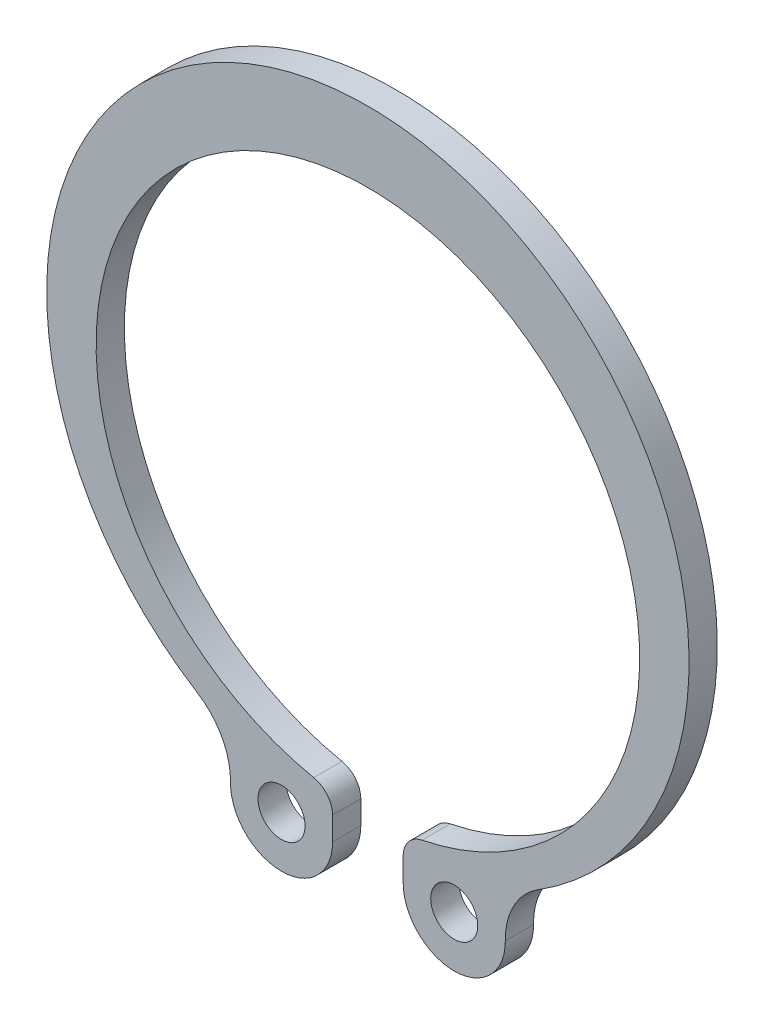
ISO-10303-21;
HEADER;
FILE_DESCRIPTION(('STEP AP214'),'2;1');
FILE_NAME('part.step','',(''),(''),'','','');
FILE_SCHEMA(('AUTOMOTIVE_DESIGN { 1 0 10303 214 1 1 1 1 }'));
ENDSEC;
DATA;
#1=APPLICATION_CONTEXT('core data for automotive mechanical design processes');
#2=APPLICATION_PROTOCOL_DEFINITION('international standard','automotive_design',2000,#1);
#3=PRODUCT_CONTEXT('',#1,'mechanical');
#4=PRODUCT('Part','Part','',(#3));
#5=PRODUCT_RELATED_PRODUCT_CATEGORY('part','',(#4));
#6=PRODUCT_DEFINITION_FORMATION('','',#4);
#7=PRODUCT_DEFINITION_CONTEXT('part definition',#1,'design');
#8=PRODUCT_DEFINITION('design','',#6,#7);
#9=PRODUCT_DEFINITION_SHAPE('','',#8);
#10=(LENGTH_UNIT() NAMED_UNIT(*) SI_UNIT(.MILLI.,.METRE.));
#11=(NAMED_UNIT(*) PLANE_ANGLE_UNIT() SI_UNIT($,.RADIAN.));
#12=(NAMED_UNIT(*) SI_UNIT($,.STERADIAN.) SOLID_ANGLE_UNIT());
#13=UNCERTAINTY_MEASURE_WITH_UNIT(LENGTH_MEASURE(1.E-05),#10,'distance_accuracy_value','');
#14=(GEOMETRIC_REPRESENTATION_CONTEXT(3) GLOBAL_UNCERTAINTY_ASSIGNED_CONTEXT((#13)) GLOBAL_UNIT_ASSIGNED_CONTEXT((#10,
#11,#12)) REPRESENTATION_CONTEXT('',''));
#15=CARTESIAN_POINT('',(0.,0.,0.));
#16=DIRECTION('',(0.,0.,1.));
#17=DIRECTION('',(1.,0.,0.));
#18=AXIS2_PLACEMENT_3D('',#15,#16,#17);
#19=CARTESIAN_POINT('',(2.50000000000009,-13.1984755152824,1.2));
#20=DIRECTION('',(0.,0.,1.));
#21=DIRECTION('',(1.,0.,0.));
#22=AXIS2_PLACEMENT_3D('',#19,#20,#21);
#23=PLANE('',#22);
#24=CARTESIAN_POINT('',(-3.66946668671078,-14.1830008896256,1.2));
#25=DIRECTION('',(0.,0.,1.));
#26=DIRECTION('',(1.,0.,0.));
#27=AXIS2_PLACEMENT_3D('',#24,#25,#26);
#28=CIRCLE('',#27,1.);
#29=CARTESIAN_POINT('',(-2.66946668671078,-14.1830008896256,1.2));
#30=VERTEX_POINT('',#29);
#31=EDGE_CURVE('E158',#30,#30,#28,.T.);
#32=ORIENTED_EDGE('',*,*,#31,.F.);
#33=EDGE_LOOP('',(#32));
#34=FACE_BOUND('',#33,.T.);
#35=CARTESIAN_POINT('',(2.50000000000009,-13.1984755152824,1.2));
#36=DIRECTION('',(0.,0.,1.));
#37=DIRECTION('',(1.,0.,0.));
#38=AXIS2_PLACEMENT_3D('',#35,#36,#37);
#39=CIRCLE('',#38,1.);
#40=CARTESIAN_POINT('',(2.30079681274909,-12.2185173068933,1.2));
#41=VERTEX_POINT('',#40);
#42=CARTESIAN_POINT('',(1.50000000000009,-13.1984755152824,1.2));
#43=VERTEX_POINT('',#42);
#44=EDGE_CURVE('E182',#41,#43,#39,.T.);
#45=ORIENTED_EDGE('',*,*,#44,.T.);
#46=DIRECTION('',(0.,-1.,0.));
#47=VECTOR('',#46,1.);
#48=CARTESIAN_POINT('',(1.5000000000001,-14.1830008896256,1.2));
#49=LINE('',#48,#47);
#50=CARTESIAN_POINT('',(1.5000000000001,-14.1830008896256,1.2));
#51=VERTEX_POINT('',#50);
#52=EDGE_CURVE('E106',#43,#51,#49,.T.);
#53=ORIENTED_EDGE('',*,*,#52,.T.);
#54=CARTESIAN_POINT('',(3.66946668671088,-14.1830008896256,1.2));
#55=DIRECTION('',(0.,0.,1.));
#56=DIRECTION('',(-1.,0.,0.));
#57=AXIS2_PLACEMENT_3D('',#54,#55,#56);
#58=CIRCLE('',#57,2.16946668671078);
#59=CARTESIAN_POINT('',(5.83871969722187,-14.1525528825175,1.2));
#60=VERTEX_POINT('',#59);
#61=EDGE_CURVE('E211',#51,#60,#58,.T.);
#62=ORIENTED_EDGE('',*,*,#61,.T.);
#63=CARTESIAN_POINT('',(8.83842421971891,-14.1104485156315,1.2));
#64=DIRECTION('',(0.,0.,-1.));
#65=DIRECTION('',(1.,0.,0.));
#66=AXIS2_PLACEMENT_3D('',#63,#64,#65);
#67=CIRCLE('',#66,3.00000000000001);
#68=CARTESIAN_POINT('',(7.24591535130107,-11.5680253596619,1.2));
#69=VERTEX_POINT('',#68);
#70=EDGE_CURVE('E231',#60,#69,#67,.T.);
#71=ORIENTED_EDGE('',*,*,#70,.T.);
#72=CARTESIAN_POINT('',(0.,0.,1.2));
#73=DIRECTION('',(0.,0.,1.));
#74=DIRECTION('',(1.,0.,0.));
#75=AXIS2_PLACEMENT_3D('',#72,#73,#74);
#76=CIRCLE('',#75,13.65);
#77=CARTESIAN_POINT('',(-7.245915351301,-11.5680253596619,1.2));
#78=VERTEX_POINT('',#77);
#79=EDGE_CURVE('E227',#69,#78,#76,.T.);
#80=ORIENTED_EDGE('',*,*,#79,.T.);
#81=CARTESIAN_POINT('',(-8.83842421971881,-14.1104485156315,1.2));
#82=DIRECTION('',(0.,0.,-1.));
#83=DIRECTION('',(-1.,0.,0.));
#84=AXIS2_PLACEMENT_3D('',#81,#82,#83);
#85=CIRCLE('',#84,3.);
#86=CARTESIAN_POINT('',(-5.83871969722178,-14.1525528825175,1.2));
#87=VERTEX_POINT('',#86);
#88=EDGE_CURVE('E230',#78,#87,#85,.T.);
#89=ORIENTED_EDGE('',*,*,#88,.T.);
#90=CARTESIAN_POINT('',(-3.66946668671078,-14.1830008896256,1.2));
#91=DIRECTION('',(0.,0.,1.));
#92=DIRECTION('',(1.,0.,0.));
#93=AXIS2_PLACEMENT_3D('',#90,#91,#92);
#94=CIRCLE('',#93,2.16946668671078);
#95=CARTESIAN_POINT('',(-1.5,-14.1830008896256,1.2));
#96=VERTEX_POINT('',#95);
#97=EDGE_CURVE('E131',#87,#96,#94,.T.);
#98=ORIENTED_EDGE('',*,*,#97,.T.);
#99=DIRECTION('',(0.,1.,0.));
#100=VECTOR('',#99,1.);
#101=CARTESIAN_POINT('',(-1.5,-14.1830008896256,1.2));
#102=LINE('',#101,#100);
#103=CARTESIAN_POINT('',(-1.5,-13.1984755152824,1.2));
#104=VERTEX_POINT('',#103);
#105=EDGE_CURVE('E125',#96,#104,#102,.T.);
#106=ORIENTED_EDGE('',*,*,#105,.T.);
#107=CARTESIAN_POINT('',(-2.5,-13.1984755152824,1.2));
#108=DIRECTION('',(0.,0.,1.));
#109=DIRECTION('',(-1.,0.,0.));
#110=AXIS2_PLACEMENT_3D('',#107,#108,#109);
#111=CIRCLE('',#110,1.);
#112=CARTESIAN_POINT('',(-2.300796812749,-12.2185173068933,1.2));
#113=VERTEX_POINT('',#112);
#114=EDGE_CURVE('E129',#104,#113,#111,.T.);
#115=ORIENTED_EDGE('',*,*,#114,.T.);
#116=CARTESIAN_POINT('',(0.,-0.9,1.2));
#117=DIRECTION('',(0.,0.,-1.));
#118=DIRECTION('',(1.,0.,0.));
#119=AXIS2_PLACEMENT_3D('',#116,#117,#118);
#120=CIRCLE('',#119,11.55);
#121=EDGE_CURVE('E57',#113,#41,#120,.T.);
#122=ORIENTED_EDGE('',*,*,#121,.T.);
#123=EDGE_LOOP('',(#45,#53,#62,#71,#80,#89,#98,#106,#115,#122));
#124=FACE_BOUND('',#123,.T.);
#125=CARTESIAN_POINT('',(3.66946668671088,-14.1830008896256,1.2));
#126=DIRECTION('',(0.,0.,1.));
#127=DIRECTION('',(-1.,0.,0.));
#128=AXIS2_PLACEMENT_3D('',#125,#126,#127);
#129=CIRCLE('',#128,1.);
#130=CARTESIAN_POINT('',(2.66946668671088,-14.1830008896256,1.2));
#131=VERTEX_POINT('',#130);
#132=EDGE_CURVE('E249',#131,#131,#129,.T.);
#133=ORIENTED_EDGE('',*,*,#132,.F.);
#134=EDGE_LOOP('',(#133));
#135=FACE_BOUND('',#134,.T.);
#136=ADVANCED_FACE('F39',(#34,#124,#135),#23,.T.);
#137=CARTESIAN_POINT('',(2.50000000000009,-13.1984755152824,0.));
#138=DIRECTION('',(0.,0.,1.));
#139=DIRECTION('',(1.,0.,0.));
#140=AXIS2_PLACEMENT_3D('',#137,#138,#139);
#141=PLANE('',#140);
#142=CARTESIAN_POINT('',(2.50000000000009,-13.1984755152824,0.));
#143=DIRECTION('',(0.,0.,1.));
#144=DIRECTION('',(1.,0.,0.));
#145=AXIS2_PLACEMENT_3D('',#142,#143,#144);
#146=CIRCLE('',#145,1.);
#147=CARTESIAN_POINT('',(2.30079681274909,-12.2185173068933,0.));
#148=VERTEX_POINT('',#147);
#149=CARTESIAN_POINT('',(1.50000000000009,-13.1984755152824,0.));
#150=VERTEX_POINT('',#149);
#151=EDGE_CURVE('E153',#148,#150,#146,.T.);
#152=ORIENTED_EDGE('',*,*,#151,.F.);
#153=CARTESIAN_POINT('',(0.,-0.9,0.));
#154=DIRECTION('',(0.,0.,-1.));
#155=DIRECTION('',(1.,0.,0.));
#156=AXIS2_PLACEMENT_3D('',#153,#154,#155);
#157=CIRCLE('',#156,11.55);
#158=CARTESIAN_POINT('',(-2.300796812749,-12.2185173068933,0.));
#159=VERTEX_POINT('',#158);
#160=EDGE_CURVE('E98',#159,#148,#157,.T.);
#161=ORIENTED_EDGE('',*,*,#160,.F.);
#162=CARTESIAN_POINT('',(-2.5,-13.1984755152824,0.));
#163=DIRECTION('',(0.,0.,1.));
#164=DIRECTION('',(-1.,0.,0.));
#165=AXIS2_PLACEMENT_3D('',#162,#163,#164);
#166=CIRCLE('',#165,1.);
#167=CARTESIAN_POINT('',(-1.5,-13.1984755152824,0.));
#168=VERTEX_POINT('',#167);
#169=EDGE_CURVE('E92',#168,#159,#166,.T.);
#170=ORIENTED_EDGE('',*,*,#169,.F.);
#171=DIRECTION('',(0.,1.,0.));
#172=VECTOR('',#171,1.);
#173=CARTESIAN_POINT('',(-1.5,-14.1830008896256,0.));
#174=LINE('',#173,#172);
#175=CARTESIAN_POINT('',(-1.5,-14.1830008896256,0.));
#176=VERTEX_POINT('',#175);
#177=EDGE_CURVE('E140',#176,#168,#174,.T.);
#178=ORIENTED_EDGE('',*,*,#177,.F.);
#179=CARTESIAN_POINT('',(-3.66946668671078,-14.1830008896256,0.));
#180=DIRECTION('',(0.,0.,1.));
#181=DIRECTION('',(1.,0.,0.));
#182=AXIS2_PLACEMENT_3D('',#179,#180,#181);
#183=CIRCLE('',#182,2.16946668671078);
#184=CARTESIAN_POINT('',(-5.83871969722178,-14.1525528825175,0.));
#185=VERTEX_POINT('',#184);
#186=EDGE_CURVE('E173',#185,#176,#183,.T.);
#187=ORIENTED_EDGE('',*,*,#186,.F.);
#188=CARTESIAN_POINT('',(-8.83842421971881,-14.1104485156315,0.));
#189=DIRECTION('',(0.,0.,-1.));
#190=DIRECTION('',(-1.,0.,0.));
#191=AXIS2_PLACEMENT_3D('',#188,#189,#190);
#192=CIRCLE('',#191,3.);
#193=CARTESIAN_POINT('',(-7.245915351301,-11.5680253596619,0.));
#194=VERTEX_POINT('',#193);
#195=EDGE_CURVE('E170',#194,#185,#192,.T.);
#196=ORIENTED_EDGE('',*,*,#195,.F.);
#197=CARTESIAN_POINT('',(0.,0.,0.));
#198=DIRECTION('',(0.,0.,1.));
#199=DIRECTION('',(1.,0.,0.));
#200=AXIS2_PLACEMENT_3D('',#197,#198,#199);
#201=CIRCLE('',#200,13.65);
#202=CARTESIAN_POINT('',(7.24591535130107,-11.5680253596619,0.));
#203=VERTEX_POINT('',#202);
#204=EDGE_CURVE('E167',#203,#194,#201,.T.);
#205=ORIENTED_EDGE('',*,*,#204,.F.);
#206=CARTESIAN_POINT('',(8.83842421971891,-14.1104485156315,0.));
#207=DIRECTION('',(0.,0.,-1.));
#208=DIRECTION('',(1.,0.,0.));
#209=AXIS2_PLACEMENT_3D('',#206,#207,#208);
#210=CIRCLE('',#209,3.00000000000001);
#211=CARTESIAN_POINT('',(5.83871969722187,-14.1525528825175,0.));
#212=VERTEX_POINT('',#211);
#213=EDGE_CURVE('E164',#212,#203,#210,.T.);
#214=ORIENTED_EDGE('',*,*,#213,.F.);
#215=CARTESIAN_POINT('',(3.66946668671088,-14.1830008896256,0.));
#216=DIRECTION('',(0.,0.,1.));
#217=DIRECTION('',(-1.,0.,0.));
#218=AXIS2_PLACEMENT_3D('',#215,#216,#217);
#219=CIRCLE('',#218,2.16946668671078);
#220=CARTESIAN_POINT('',(1.5000000000001,-14.1830008896256,0.));
#221=VERTEX_POINT('',#220);
#222=EDGE_CURVE('E161',#221,#212,#219,.T.);
#223=ORIENTED_EDGE('',*,*,#222,.F.);
#224=DIRECTION('',(0.,-1.,0.));
#225=VECTOR('',#224,1.);
#226=CARTESIAN_POINT('',(1.5000000000001,-14.1830008896256,0.));
#227=LINE('',#226,#225);
#228=EDGE_CURVE('E157',#150,#221,#227,.T.);
#229=ORIENTED_EDGE('',*,*,#228,.F.);
#230=EDGE_LOOP('',(#152,#161,#170,#178,#187,#196,#205,#214,#223,#229));
#231=FACE_BOUND('',#230,.T.);
#232=CARTESIAN_POINT('',(-3.66946668671078,-14.1830008896256,0.));
#233=DIRECTION('',(0.,0.,1.));
#234=DIRECTION('',(1.,0.,0.));
#235=AXIS2_PLACEMENT_3D('',#232,#233,#234);
#236=CIRCLE('',#235,1.);
#237=CARTESIAN_POINT('',(-2.66946668671078,-14.1830008896256,0.));
#238=VERTEX_POINT('',#237);
#239=EDGE_CURVE('E245',#238,#238,#236,.T.);
#240=ORIENTED_EDGE('',*,*,#239,.T.);
#241=EDGE_LOOP('',(#240));
#242=FACE_BOUND('',#241,.T.);
#243=CARTESIAN_POINT('',(3.66946668671088,-14.1830008896256,0.));
#244=DIRECTION('',(0.,0.,1.));
#245=DIRECTION('',(-1.,0.,0.));
#246=AXIS2_PLACEMENT_3D('',#243,#244,#245);
#247=CIRCLE('',#246,1.);
#248=CARTESIAN_POINT('',(2.66946668671088,-14.1830008896256,0.));
#249=VERTEX_POINT('',#248);
#250=EDGE_CURVE('E253',#249,#249,#247,.T.);
#251=ORIENTED_EDGE('',*,*,#250,.T.);
#252=EDGE_LOOP('',(#251));
#253=FACE_BOUND('',#252,.T.);
#254=ADVANCED_FACE('F215',(#231,#242,#253),#141,.F.);
#255=CARTESIAN_POINT('',(2.50000000000009,-13.1984755152824,1.2));
#256=DIRECTION('',(0.,0.,-1.));
#257=DIRECTION('',(-1.,0.,0.));
#258=AXIS2_PLACEMENT_3D('',#255,#256,#257);
#259=CYLINDRICAL_SURFACE('',#258,1.);
#260=ORIENTED_EDGE('',*,*,#151,.T.);
#261=DIRECTION('',(0.,0.,-1.));
#262=VECTOR('',#261,1.);
#263=CARTESIAN_POINT('',(1.50000000000009,-13.1984755152824,1.2));
#264=LINE('',#263,#262);
#265=EDGE_CURVE('E11',#43,#150,#264,.T.);
#266=ORIENTED_EDGE('',*,*,#265,.F.);
#267=ORIENTED_EDGE('',*,*,#44,.F.);
#268=DIRECTION('',(0.,0.,-1.));
#269=VECTOR('',#268,1.);
#270=CARTESIAN_POINT('',(2.30079681274909,-12.2185173068933,1.2));
#271=LINE('',#270,#269);
#272=EDGE_CURVE('E149',#41,#148,#271,.T.);
#273=ORIENTED_EDGE('',*,*,#272,.T.);
#274=EDGE_LOOP('',(#260,#266,#267,#273));
#275=FACE_BOUND('',#274,.T.);
#276=ADVANCED_FACE('F41',(#275),#259,.T.);
#277=CARTESIAN_POINT('',(1.5000000000001,-14.1830008896256,1.2));
#278=DIRECTION('',(1.,0.,0.));
#279=DIRECTION('',(0.,1.,0.));
#280=AXIS2_PLACEMENT_3D('',#277,#278,#279);
#281=PLANE('',#280);
#282=ORIENTED_EDGE('',*,*,#228,.T.);
#283=DIRECTION('',(0.,0.,-1.));
#284=VECTOR('',#283,1.);
#285=CARTESIAN_POINT('',(1.5000000000001,-14.1830008896256,1.2));
#286=LINE('',#285,#284);
#287=EDGE_CURVE('E49',#51,#221,#286,.T.);
#288=ORIENTED_EDGE('',*,*,#287,.F.);
#289=ORIENTED_EDGE('',*,*,#52,.F.);
#290=ORIENTED_EDGE('',*,*,#265,.T.);
#291=EDGE_LOOP('',(#282,#288,#289,#290));
#292=FACE_BOUND('',#291,.T.);
#293=ADVANCED_FACE('F295',(#292),#281,.F.);
#294=CARTESIAN_POINT('',(3.66946668671088,-14.1830008896256,1.2));
#295=DIRECTION('',(0.,0.,-1.));
#296=DIRECTION('',(-1.,0.,0.));
#297=AXIS2_PLACEMENT_3D('',#294,#295,#296);
#298=CYLINDRICAL_SURFACE('',#297,2.16946668671078);
#299=ORIENTED_EDGE('',*,*,#222,.T.);
#300=DIRECTION('',(0.,0.,-1.));
#301=VECTOR('',#300,1.);
#302=CARTESIAN_POINT('',(5.83871969722187,-14.1525528825175,1.2));
#303=LINE('',#302,#301);
#304=EDGE_CURVE('E201',#60,#212,#303,.T.);
#305=ORIENTED_EDGE('',*,*,#304,.F.);
#306=ORIENTED_EDGE('',*,*,#61,.F.);
#307=ORIENTED_EDGE('',*,*,#287,.T.);
#308=EDGE_LOOP('',(#299,#305,#306,#307));
#309=FACE_BOUND('',#308,.T.);
#310=ADVANCED_FACE('F209',(#309),#298,.T.);
#311=CARTESIAN_POINT('',(8.83842421971891,-14.1104485156315,1.2));
#312=DIRECTION('',(0.,0.,-1.));
#313=DIRECTION('',(-1.,0.,0.));
#314=AXIS2_PLACEMENT_3D('',#311,#312,#313);
#315=CYLINDRICAL_SURFACE('',#314,3.00000000000001);
#316=ORIENTED_EDGE('',*,*,#213,.T.);
#317=DIRECTION('',(0.,0.,-1.));
#318=VECTOR('',#317,1.);
#319=CARTESIAN_POINT('',(7.24591535130107,-11.5680253596619,1.2));
#320=LINE('',#319,#318);
#321=EDGE_CURVE('E197',#69,#203,#320,.T.);
#322=ORIENTED_EDGE('',*,*,#321,.F.);
#323=ORIENTED_EDGE('',*,*,#70,.F.);
#324=ORIENTED_EDGE('',*,*,#304,.T.);
#325=EDGE_LOOP('',(#316,#322,#323,#324));
#326=FACE_BOUND('',#325,.T.);
#327=ADVANCED_FACE('F221',(#326),#315,.F.);
#328=CARTESIAN_POINT('',(0.,0.,1.2));
#329=DIRECTION('',(0.,0.,-1.));
#330=DIRECTION('',(-1.,0.,0.));
#331=AXIS2_PLACEMENT_3D('',#328,#329,#330);
#332=CYLINDRICAL_SURFACE('',#331,13.65);
#333=ORIENTED_EDGE('',*,*,#204,.T.);
#334=DIRECTION('',(0.,0.,-1.));
#335=VECTOR('',#334,1.);
#336=CARTESIAN_POINT('',(-7.245915351301,-11.5680253596619,1.2));
#337=LINE('',#336,#335);
#338=EDGE_CURVE('E193',#78,#194,#337,.T.);
#339=ORIENTED_EDGE('',*,*,#338,.F.);
#340=ORIENTED_EDGE('',*,*,#79,.F.);
#341=ORIENTED_EDGE('',*,*,#321,.T.);
#342=EDGE_LOOP('',(#333,#339,#340,#341));
#343=FACE_BOUND('',#342,.T.);
#344=ADVANCED_FACE('F225',(#343),#332,.T.);
#345=CARTESIAN_POINT('',(-8.83842421971881,-14.1104485156315,1.2));
#346=DIRECTION('',(0.,0.,-1.));
#347=DIRECTION('',(-1.,0.,0.));
#348=AXIS2_PLACEMENT_3D('',#345,#346,#347);
#349=CYLINDRICAL_SURFACE('',#348,3.);
#350=ORIENTED_EDGE('',*,*,#195,.T.);
#351=DIRECTION('',(0.,0.,-1.));
#352=VECTOR('',#351,1.);
#353=CARTESIAN_POINT('',(-5.83871969722178,-14.1525528825175,1.2));
#354=LINE('',#353,#352);
#355=EDGE_CURVE('E189',#87,#185,#354,.T.);
#356=ORIENTED_EDGE('',*,*,#355,.F.);
#357=ORIENTED_EDGE('',*,*,#88,.F.);
#358=ORIENTED_EDGE('',*,*,#338,.T.);
#359=EDGE_LOOP('',(#350,#356,#357,#358));
#360=FACE_BOUND('',#359,.T.);
#361=ADVANCED_FACE('F285',(#360),#349,.F.);
#362=CARTESIAN_POINT('',(-3.66946668671078,-14.1830008896256,1.2));
#363=DIRECTION('',(0.,0.,-1.));
#364=DIRECTION('',(-1.,0.,0.));
#365=AXIS2_PLACEMENT_3D('',#362,#363,#364);
#366=CYLINDRICAL_SURFACE('',#365,2.16946668671078);
#367=ORIENTED_EDGE('',*,*,#186,.T.);
#368=DIRECTION('',(0.,0.,-1.));
#369=VECTOR('',#368,1.);
#370=CARTESIAN_POINT('',(-1.5,-14.1830008896256,1.2));
#371=LINE('',#370,#369);
#372=EDGE_CURVE('E142',#96,#176,#371,.T.);
#373=ORIENTED_EDGE('',*,*,#372,.F.);
#374=ORIENTED_EDGE('',*,*,#97,.F.);
#375=ORIENTED_EDGE('',*,*,#355,.T.);
#376=EDGE_LOOP('',(#367,#373,#374,#375));
#377=FACE_BOUND('',#376,.T.);
#378=ADVANCED_FACE('F282',(#377),#366,.T.);
#379=CARTESIAN_POINT('',(-1.5,-14.1830008896256,1.2));
#380=DIRECTION('',(-1.,0.,0.));
#381=DIRECTION('',(0.,-1.,0.));
#382=AXIS2_PLACEMENT_3D('',#379,#380,#381);
#383=PLANE('',#382);
#384=ORIENTED_EDGE('',*,*,#177,.T.);
#385=DIRECTION('',(0.,0.,-1.));
#386=VECTOR('',#385,1.);
#387=CARTESIAN_POINT('',(-1.5,-13.1984755152824,1.2));
#388=LINE('',#387,#386);
#389=EDGE_CURVE('E137',#104,#168,#388,.T.);
#390=ORIENTED_EDGE('',*,*,#389,.F.);
#391=ORIENTED_EDGE('',*,*,#105,.F.);
#392=ORIENTED_EDGE('',*,*,#372,.T.);
#393=EDGE_LOOP('',(#384,#390,#391,#392));
#394=FACE_BOUND('',#393,.T.);
#395=ADVANCED_FACE('F138',(#394),#383,.F.);
#396=CARTESIAN_POINT('',(-2.5,-13.1984755152824,1.2));
#397=DIRECTION('',(0.,0.,-1.));
#398=DIRECTION('',(-1.,0.,0.));
#399=AXIS2_PLACEMENT_3D('',#396,#397,#398);
#400=CYLINDRICAL_SURFACE('',#399,1.);
#401=ORIENTED_EDGE('',*,*,#169,.T.);
#402=DIRECTION('',(0.,0.,-1.));
#403=VECTOR('',#402,1.);
#404=CARTESIAN_POINT('',(-2.300796812749,-12.2185173068933,1.2));
#405=LINE('',#404,#403);
#406=EDGE_CURVE('E143',#113,#159,#405,.T.);
#407=ORIENTED_EDGE('',*,*,#406,.F.);
#408=ORIENTED_EDGE('',*,*,#114,.F.);
#409=ORIENTED_EDGE('',*,*,#389,.T.);
#410=EDGE_LOOP('',(#401,#407,#408,#409));
#411=FACE_BOUND('',#410,.T.);
#412=ADVANCED_FACE('F145',(#411),#400,.T.);
#413=CARTESIAN_POINT('',(0.,-0.9,1.2));
#414=DIRECTION('',(0.,0.,-1.));
#415=DIRECTION('',(-1.,0.,0.));
#416=AXIS2_PLACEMENT_3D('',#413,#414,#415);
#417=CYLINDRICAL_SURFACE('',#416,11.55);
#418=ORIENTED_EDGE('',*,*,#160,.T.);
#419=ORIENTED_EDGE('',*,*,#272,.F.);
#420=ORIENTED_EDGE('',*,*,#121,.F.);
#421=ORIENTED_EDGE('',*,*,#406,.T.);
#422=EDGE_LOOP('',(#418,#419,#420,#421));
#423=FACE_BOUND('',#422,.T.);
#424=ADVANCED_FACE('F275',(#423),#417,.F.);
#425=CARTESIAN_POINT('',(-3.66946668671078,-14.1830008896256,1.2));
#426=DIRECTION('',(0.,0.,-1.));
#427=DIRECTION('',(-1.,0.,0.));
#428=AXIS2_PLACEMENT_3D('',#425,#426,#427);
#429=CYLINDRICAL_SURFACE('',#428,1.);
#430=ORIENTED_EDGE('',*,*,#31,.T.);
#431=EDGE_LOOP('',(#430));
#432=FACE_BOUND('',#431,.T.);
#433=ORIENTED_EDGE('',*,*,#239,.F.);
#434=EDGE_LOOP('',(#433));
#435=FACE_BOUND('',#434,.T.);
#436=ADVANCED_FACE('F272',(#432,#435),#429,.F.);
#437=CARTESIAN_POINT('',(3.66946668671088,-14.1830008896256,1.2));
#438=DIRECTION('',(0.,0.,-1.));
#439=DIRECTION('',(-1.,0.,0.));
#440=AXIS2_PLACEMENT_3D('',#437,#438,#439);
#441=CYLINDRICAL_SURFACE('',#440,1.);
#442=ORIENTED_EDGE('',*,*,#132,.T.);
#443=EDGE_LOOP('',(#442));
#444=FACE_BOUND('',#443,.T.);
#445=ORIENTED_EDGE('',*,*,#250,.F.);
#446=EDGE_LOOP('',(#445));
#447=FACE_BOUND('',#446,.T.);
#448=ADVANCED_FACE('F261',(#444,#447),#441,.F.);
#449=CLOSED_SHELL('',(#136,#254,#276,#293,#310,#327,#344,#361,#378,#395,#412,#424,#436,#448));
#450=MANIFOLD_SOLID_BREP('B2',#449);
#451=ADVANCED_BREP_SHAPE_REPRESENTATION('',(#18,#450),#14);
#452=SHAPE_DEFINITION_REPRESENTATION(#9,#451);
ENDSEC;
END-ISO-10303-21;
